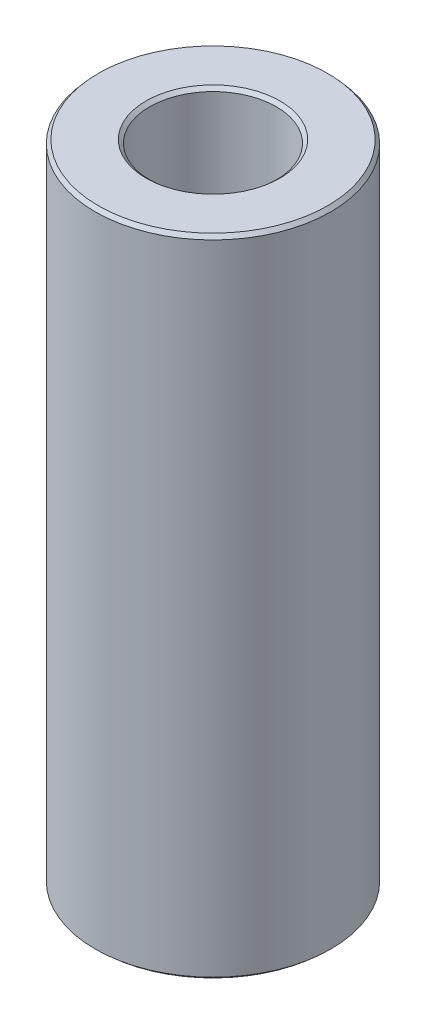
ISO-10303-21;
HEADER;
FILE_DESCRIPTION(('STEP AP214'),'2;1');
FILE_NAME('part.step','',(''),(''),'','','');
FILE_SCHEMA(('AUTOMOTIVE_DESIGN { 1 0 10303 214 1 1 1 1 }'));
ENDSEC;
DATA;
#1=APPLICATION_CONTEXT('core data for automotive mechanical design processes');
#2=APPLICATION_PROTOCOL_DEFINITION('international standard','automotive_design',2000,#1);
#3=PRODUCT_CONTEXT('',#1,'mechanical');
#4=PRODUCT('Part','Part','',(#3));
#5=PRODUCT_RELATED_PRODUCT_CATEGORY('part','',(#4));
#6=PRODUCT_DEFINITION_FORMATION('','',#4);
#7=PRODUCT_DEFINITION_CONTEXT('part definition',#1,'design');
#8=PRODUCT_DEFINITION('design','',#6,#7);
#9=PRODUCT_DEFINITION_SHAPE('','',#8);
#10=(LENGTH_UNIT() NAMED_UNIT(*) SI_UNIT(.MILLI.,.METRE.));
#11=(NAMED_UNIT(*) PLANE_ANGLE_UNIT() SI_UNIT($,.RADIAN.));
#12=(NAMED_UNIT(*) SI_UNIT($,.STERADIAN.) SOLID_ANGLE_UNIT());
#13=UNCERTAINTY_MEASURE_WITH_UNIT(LENGTH_MEASURE(1.E-05),#10,'distance_accuracy_value','');
#14=(GEOMETRIC_REPRESENTATION_CONTEXT(3) GLOBAL_UNCERTAINTY_ASSIGNED_CONTEXT((#13)) GLOBAL_UNIT_ASSIGNED_CONTEXT((#10,
#11,#12)) REPRESENTATION_CONTEXT('',''));
#15=CARTESIAN_POINT('',(0.,0.,0.));
#16=DIRECTION('',(0.,0.,1.));
#17=DIRECTION('',(1.,0.,0.));
#18=AXIS2_PLACEMENT_3D('',#15,#16,#17);
#19=CARTESIAN_POINT('',(0.,54.7454470215542,0.));
#20=DIRECTION('',(0.,-1.,0.));
#21=DIRECTION('',(0.,0.,-1.));
#22=AXIS2_PLACEMENT_3D('',#19,#20,#21);
#23=CYLINDRICAL_SURFACE('',#22,10.);
#24=CARTESIAN_POINT('',(0.,0.273184243306336,0.));
#25=DIRECTION('',(0.,1.,0.));
#26=DIRECTION('',(0.,0.,1.));
#27=AXIS2_PLACEMENT_3D('',#24,#25,#26);
#28=CIRCLE('',#27,10.);
#29=CARTESIAN_POINT('',(0.,0.273184243306336,10.));
#30=VERTEX_POINT('',#29);
#31=EDGE_CURVE('E10',#30,#30,#28,.T.);
#32=ORIENTED_EDGE('',*,*,#31,.T.);
#33=EDGE_LOOP('',(#32));
#34=FACE_BOUND('',#33,.T.);
#35=CARTESIAN_POINT('',(0.,54.4367198620859,0.));
#36=DIRECTION('',(0.,1.,0.));
#37=DIRECTION('',(0.,0.,1.));
#38=AXIS2_PLACEMENT_3D('',#35,#36,#37);
#39=CIRCLE('',#38,10.);
#40=CARTESIAN_POINT('',(0.,54.4367198620859,10.));
#41=VERTEX_POINT('',#40);
#42=EDGE_CURVE('E50',#41,#41,#39,.F.);
#43=ORIENTED_EDGE('',*,*,#42,.T.);
#44=EDGE_LOOP('',(#43));
#45=FACE_BOUND('',#44,.T.);
#46=ADVANCED_FACE('F39',(#34,#45),#23,.T.);
#47=CARTESIAN_POINT('',(0.,54.7454470215542,0.));
#48=DIRECTION('',(0.,1.,0.));
#49=DIRECTION('',(0.,0.,1.));
#50=AXIS2_PLACEMENT_3D('',#47,#48,#49);
#51=PLANE('',#50);
#52=CARTESIAN_POINT('',(0.,54.7454470215542,0.));
#53=DIRECTION('',(0.,1.,0.));
#54=DIRECTION('',(0.,0.,1.));
#55=AXIS2_PLACEMENT_3D('',#52,#53,#54);
#56=CIRCLE('',#55,5.68198857181001);
#57=CARTESIAN_POINT('',(0.,54.7454470215542,5.68198857181001));
#58=VERTEX_POINT('',#57);
#59=EDGE_CURVE('E58',#58,#58,#56,.F.);
#60=ORIENTED_EDGE('',*,*,#59,.T.);
#61=EDGE_LOOP('',(#60));
#62=FACE_BOUND('',#61,.T.);
#63=CARTESIAN_POINT('',(0.,54.7454470215542,0.));
#64=DIRECTION('',(0.,1.,0.));
#65=DIRECTION('',(0.,0.,1.));
#66=AXIS2_PLACEMENT_3D('',#63,#64,#65);
#67=CIRCLE('',#66,9.72681575669367);
#68=CARTESIAN_POINT('',(0.,54.7454470215542,9.72681575669367));
#69=VERTEX_POINT('',#68);
#70=EDGE_CURVE('E61',#69,#69,#67,.T.);
#71=ORIENTED_EDGE('',*,*,#70,.T.);
#72=EDGE_LOOP('',(#71));
#73=FACE_BOUND('',#72,.T.);
#74=ADVANCED_FACE('F88',(#62,#73),#51,.T.);
#75=CARTESIAN_POINT('',(0.,0.,0.));
#76=DIRECTION('',(0.,1.,0.));
#77=DIRECTION('',(0.,0.,1.));
#78=AXIS2_PLACEMENT_3D('',#75,#76,#77);
#79=PLANE('',#78);
#80=CARTESIAN_POINT('',(0.,0.,0.));
#81=DIRECTION('',(0.,1.,0.));
#82=DIRECTION('',(0.,0.,1.));
#83=AXIS2_PLACEMENT_3D('',#80,#81,#82);
#84=CIRCLE('',#83,5.6464456556481);
#85=CARTESIAN_POINT('',(0.,0.,-5.6464456556481));
#86=VERTEX_POINT('',#85);
#87=EDGE_CURVE('E51',#86,#86,#84,.T.);
#88=ORIENTED_EDGE('',*,*,#87,.T.);
#89=EDGE_LOOP('',(#88));
#90=FACE_BOUND('',#89,.T.);
#91=CARTESIAN_POINT('',(0.,0.,0.));
#92=DIRECTION('',(0.,1.,0.));
#93=DIRECTION('',(0.,0.,1.));
#94=AXIS2_PLACEMENT_3D('',#91,#92,#93);
#95=CIRCLE('',#94,9.69127284053176);
#96=CARTESIAN_POINT('',(0.,0.,9.69127284053176));
#97=VERTEX_POINT('',#96);
#98=EDGE_CURVE('E54',#97,#97,#95,.F.);
#99=ORIENTED_EDGE('',*,*,#98,.T.);
#100=EDGE_LOOP('',(#99));
#101=FACE_BOUND('',#100,.T.);
#102=ADVANCED_FACE('F83',(#90,#101),#79,.F.);
#103=CARTESIAN_POINT('',(0.,54.7454470215542,0.));
#104=DIRECTION('',(0.,-1.,0.));
#105=DIRECTION('',(0.,0.,-1.));
#106=AXIS2_PLACEMENT_3D('',#103,#104,#105);
#107=CYLINDRICAL_SURFACE('',#106,5.37326141234176);
#108=CARTESIAN_POINT('',(0.,54.4722627782478,0.));
#109=DIRECTION('',(0.,1.,0.));
#110=DIRECTION('',(0.,0.,1.));
#111=AXIS2_PLACEMENT_3D('',#108,#109,#110);
#112=CIRCLE('',#111,5.37326141234176);
#113=CARTESIAN_POINT('',(0.,54.4722627782478,5.37326141234176));
#114=VERTEX_POINT('',#113);
#115=EDGE_CURVE('E67',#114,#114,#112,.T.);
#116=ORIENTED_EDGE('',*,*,#115,.T.);
#117=EDGE_LOOP('',(#116));
#118=FACE_BOUND('',#117,.T.);
#119=CARTESIAN_POINT('',(0.,0.308727159468246,0.));
#120=DIRECTION('',(0.,1.,0.));
#121=DIRECTION('',(0.,0.,1.));
#122=AXIS2_PLACEMENT_3D('',#119,#120,#121);
#123=CIRCLE('',#122,5.37326141234176);
#124=CARTESIAN_POINT('',(0.,0.308727159468246,-5.37326141234176));
#125=VERTEX_POINT('',#124);
#126=EDGE_CURVE('E69',#125,#125,#123,.F.);
#127=ORIENTED_EDGE('',*,*,#126,.T.);
#128=EDGE_LOOP('',(#127));
#129=FACE_BOUND('',#128,.T.);
#130=ADVANCED_FACE('F71',(#118,#129),#107,.F.);
#131=CARTESIAN_POINT('',(0.,54.4722627782478,0.));
#132=DIRECTION('',(0.,1.,0.));
#133=DIRECTION('',(0.,0.,1.));
#134=AXIS2_PLACEMENT_3D('',#131,#132,#133);
#135=CONICAL_SURFACE('',#134,5.37326141234176,0.84640197682022);
#136=ORIENTED_EDGE('',*,*,#59,.F.);
#137=EDGE_LOOP('',(#136));
#138=FACE_BOUND('',#137,.T.);
#139=ORIENTED_EDGE('',*,*,#115,.F.);
#140=EDGE_LOOP('',(#139));
#141=FACE_BOUND('',#140,.T.);
#142=ADVANCED_FACE('F77',(#138,#141),#135,.F.);
#143=CARTESIAN_POINT('',(0.,0.,0.));
#144=DIRECTION('',(0.,-1.,0.));
#145=DIRECTION('',(0.,0.,-1.));
#146=AXIS2_PLACEMENT_3D('',#143,#144,#145);
#147=CONICAL_SURFACE('',#146,5.6464456556481,0.724394349974681);
#148=CARTESIAN_POINT('',(0.,0.308727159468246,-5.37326141234176));
#149=CARTESIAN_POINT('',(0.,0.305511251557118,-5.37610708154287));
#150=CARTESIAN_POINT('',(0.,0.302295343645991,-5.37895275074398));
#151=CARTESIAN_POINT('',(0.,0.295863527823736,-5.38464408914619));
#152=CARTESIAN_POINT('',(0.,0.292647619912608,-5.3874897583473));
#153=CARTESIAN_POINT('',(0.,0.286215804090353,-5.39318109674951));
#154=CARTESIAN_POINT('',(0.,0.282999896179225,-5.39602676595062));
#155=CARTESIAN_POINT('',(0.,0.27656808035697,-5.40171810435284));
#156=CARTESIAN_POINT('',(0.,0.273352172445843,-5.40456377355394));
#157=CARTESIAN_POINT('',(0.,0.266920356623587,-5.41025511195616));
#158=CARTESIAN_POINT('',(0.,0.26370444871246,-5.41310078115727));
#159=CARTESIAN_POINT('',(0.,0.257272632890205,-5.41879211955948));
#160=CARTESIAN_POINT('',(0.,0.254056724979077,-5.42163778876059));
#161=CARTESIAN_POINT('',(0.,0.247624909156822,-5.42732912716281));
#162=CARTESIAN_POINT('',(0.,0.244409001245695,-5.43017479636391));
#163=CARTESIAN_POINT('',(0.,0.237977185423439,-5.43586613476613));
#164=CARTESIAN_POINT('',(0.,0.234761277512312,-5.43871180396724));
#165=CARTESIAN_POINT('',(0.,0.228329461690057,-5.44440314236945));
#166=CARTESIAN_POINT('',(0.,0.225113553778929,-5.44724881157056));
#167=CARTESIAN_POINT('',(0.,0.218681737956674,-5.45294014997278));
#168=CARTESIAN_POINT('',(0.,0.215465830045547,-5.45578581917388));
#169=CARTESIAN_POINT('',(0.,0.209034014223291,-5.4614771575761));
#170=CARTESIAN_POINT('',(0.,0.205818106312164,-5.46432282677721));
#171=CARTESIAN_POINT('',(0.,0.199386290489909,-5.47001416517942));
#172=CARTESIAN_POINT('',(0.,0.196170382578781,-5.47285983438053));
#173=CARTESIAN_POINT('',(0.,0.189738566756526,-5.47855117278274));
#174=CARTESIAN_POINT('',(0.,0.186522658845399,-5.48139684198385));
#175=CARTESIAN_POINT('',(0.,0.180090843023143,-5.48708818038607));
#176=CARTESIAN_POINT('',(0.,0.176874935112016,-5.48993384958718));
#177=CARTESIAN_POINT('',(0.,0.170443119289761,-5.49562518798939));
#178=CARTESIAN_POINT('',(0.,0.167227211378633,-5.4984708571905));
#179=CARTESIAN_POINT('',(0.,0.160795395556378,-5.50416219559271));
#180=CARTESIAN_POINT('',(0.,0.157579487645251,-5.50700786479382));
#181=CARTESIAN_POINT('',(0.,0.151147671822995,-5.51269920319604));
#182=CARTESIAN_POINT('',(0.,0.147931763911868,-5.51554487239714));
#183=CARTESIAN_POINT('',(0.,0.141499948089613,-5.52123621079936));
#184=CARTESIAN_POINT('',(0.,0.138284040178485,-5.52408188000047));
#185=CARTESIAN_POINT('',(0.,0.13185222435623,-5.52977321840268));
#186=CARTESIAN_POINT('',(0.,0.128636316445102,-5.53261888760379));
#187=CARTESIAN_POINT('',(0.,0.122204500622847,-5.53831022600601));
#188=CARTESIAN_POINT('',(0.,0.11898859271172,-5.54115589520711));
#189=CARTESIAN_POINT('',(0.,0.112556776889465,-5.54684723360933));
#190=CARTESIAN_POINT('',(0.,0.109340868978337,-5.54969290281044));
#191=CARTESIAN_POINT('',(0.,0.102909053156082,-5.55538424121265));
#192=CARTESIAN_POINT('',(0.,0.0996931452449544,-5.55822991041376));
#193=CARTESIAN_POINT('',(0.,0.0932613294226992,-5.56392124881598));
#194=CARTESIAN_POINT('',(0.,0.0900454215115716,-5.56676691801708));
#195=CARTESIAN_POINT('',(0.,0.0836136056893165,-5.5724582564193));
#196=CARTESIAN_POINT('',(0.,0.0803976977781891,-5.57530392562041));
#197=CARTESIAN_POINT('',(0.,0.073965881955934,-5.58099526402262));
#198=CARTESIAN_POINT('',(0.,0.0707499740448063,-5.58384093322373));
#199=CARTESIAN_POINT('',(0.,0.0643181582225512,-5.58953227162594));
#200=CARTESIAN_POINT('',(0.,0.0611022503114237,-5.59237794082705));
#201=CARTESIAN_POINT('',(0.,0.0546704344891685,-5.59806927922927));
#202=CARTESIAN_POINT('',(0.,0.0514545265780409,-5.60091494843038));
#203=CARTESIAN_POINT('',(0.,0.0450227107557858,-5.60660628683259));
#204=CARTESIAN_POINT('',(0.,0.0418068028446583,-5.6094519560337));
#205=CARTESIAN_POINT('',(0.,0.0353749870224033,-5.61514329443591));
#206=CARTESIAN_POINT('',(0.,0.0321590791112756,-5.61798896363702));
#207=CARTESIAN_POINT('',(0.,0.0257272632890204,-5.62368030203924));
#208=CARTESIAN_POINT('',(0.,0.0225113553778928,-5.62652597124034));
#209=CARTESIAN_POINT('',(0.,0.0160795395556377,-5.63221730964256));
#210=CARTESIAN_POINT('',(0.,0.0128636316445102,-5.63506297884367));
#211=CARTESIAN_POINT('',(0.,0.00643181582225526,-5.64075431724588));
#212=CARTESIAN_POINT('',(0.,0.00321590791112777,-5.64359998644699));
#213=CARTESIAN_POINT('',(0.,0.,-5.6464456556481));
#214=B_SPLINE_CURVE_WITH_KNOTS('',3,(#148,#149,#150,#151,#152,#153,#154,#155,#156,#157,#158,
#159,#160,#161,#162,#163,#164,#165,#166,#167,#168,#169,#170,#171,#172,#173,#174,#175,#176,#177,
#178,#179,#180,#181,#182,#183,#184,#185,#186,#187,#188,#189,#190,#191,#192,#193,#194,#195,#196,
#197,#198,#199,#200,#201,#202,#203,#204,#205,#206,#207,#208,#209,#210,#211,#212,#213),
.UNSPECIFIED.,.F.,.F.,(4,2,2,2,2,2,2,2,2,2,2,2,2,2,2,2,2,2,2,2,2,2,2,2,2,2,2,2,2,2,2,2,4),(0.,
0.0128825103165053,0.0257650206330113,0.0386475309495166,0.0515300412660219,0.0644125515825279,
0.0772950618990332,0.0901775722155385,0.103060082532044,0.11594259284855,0.128825103165055,
0.14170761348156,0.154590123798066,0.167472634114572,0.180355144431077,0.193237654747583,
0.206120165064088,0.219002675380594,0.2318851856971,0.244767696013605,0.25765020633011,
0.270532716646616,0.283415226963121,0.296297737279627,0.309180247596133,0.322062757912638,
0.334945268229143,0.347827778545649,0.360710288862155,0.37359279917866,0.386475309495165,
0.399357819811671,0.412240330128177),.UNSPECIFIED.);
#215=EDGE_CURVE('BSEAM73',#125,#86,#214,.T.);
#216=ORIENTED_EDGE('',*,*,#126,.F.);
#217=ORIENTED_EDGE('',*,*,#87,.F.);
#218=ORIENTED_EDGE('',*,*,#215,.T.);
#219=ORIENTED_EDGE('',*,*,#215,.F.);
#220=EDGE_LOOP('',(#216,#218,#217,#219));
#221=FACE_BOUND('',#220,.T.);
#222=ADVANCED_FACE('F73',(#221),#147,.F.);
#223=CARTESIAN_POINT('',(0.,0.273184243306336,0.));
#224=DIRECTION('',(0.,1.,0.));
#225=DIRECTION('',(0.,0.,1.));
#226=AXIS2_PLACEMENT_3D('',#223,#224,#225);
#227=CONICAL_SURFACE('',#226,10.,0.846401976820219);
#228=ORIENTED_EDGE('',*,*,#98,.F.);
#229=EDGE_LOOP('',(#228));
#230=FACE_BOUND('',#229,.T.);
#231=ORIENTED_EDGE('',*,*,#31,.F.);
#232=EDGE_LOOP('',(#231));
#233=FACE_BOUND('',#232,.T.);
#234=ADVANCED_FACE('F76',(#230,#233),#227,.T.);
#235=CARTESIAN_POINT('',(0.,54.7454470215542,0.));
#236=DIRECTION('',(0.,-1.,0.));
#237=DIRECTION('',(0.,0.,-1.));
#238=AXIS2_PLACEMENT_3D('',#235,#236,#237);
#239=CONICAL_SURFACE('',#238,9.72681575669367,0.724394349974656);
#240=ORIENTED_EDGE('',*,*,#42,.F.);
#241=EDGE_LOOP('',(#240));
#242=FACE_BOUND('',#241,.T.);
#243=ORIENTED_EDGE('',*,*,#70,.F.);
#244=EDGE_LOOP('',(#243));
#245=FACE_BOUND('',#244,.T.);
#246=ADVANCED_FACE('F45',(#242,#245),#239,.T.);
#247=CLOSED_SHELL('',(#46,#74,#102,#130,#142,#222,#234,#246));
#248=MANIFOLD_SOLID_BREP('B2',#247);
#249=ADVANCED_BREP_SHAPE_REPRESENTATION('',(#18,#248),#14);
#250=SHAPE_DEFINITION_REPRESENTATION(#9,#249);
ENDSEC;
END-ISO-10303-21;
